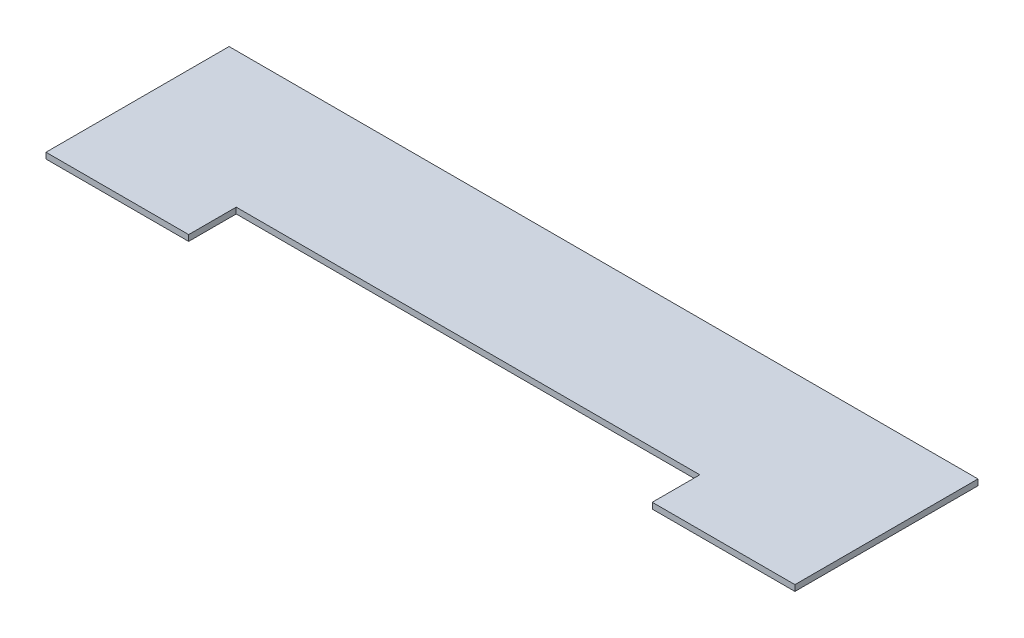
ISO-10303-21;
HEADER;
FILE_DESCRIPTION(('STEP AP214'),'2;1');
FILE_NAME('part.step','',(''),(''),'','','');
FILE_SCHEMA(('AUTOMOTIVE_DESIGN { 1 0 10303 214 1 1 1 1 }'));
ENDSEC;
DATA;
#1=APPLICATION_CONTEXT('core data for automotive mechanical design processes');
#2=APPLICATION_PROTOCOL_DEFINITION('international standard','automotive_design',2000,#1);
#3=PRODUCT_CONTEXT('',#1,'mechanical');
#4=PRODUCT('Part','Part','',(#3));
#5=PRODUCT_RELATED_PRODUCT_CATEGORY('part','',(#4));
#6=PRODUCT_DEFINITION_FORMATION('','',#4);
#7=PRODUCT_DEFINITION_CONTEXT('part definition',#1,'design');
#8=PRODUCT_DEFINITION('design','',#6,#7);
#9=PRODUCT_DEFINITION_SHAPE('','',#8);
#10=(LENGTH_UNIT() NAMED_UNIT(*) SI_UNIT(.MILLI.,.METRE.));
#11=(NAMED_UNIT(*) PLANE_ANGLE_UNIT() SI_UNIT($,.RADIAN.));
#12=(NAMED_UNIT(*) SI_UNIT($,.STERADIAN.) SOLID_ANGLE_UNIT());
#13=UNCERTAINTY_MEASURE_WITH_UNIT(LENGTH_MEASURE(1.E-05),#10,'distance_accuracy_value','');
#14=(GEOMETRIC_REPRESENTATION_CONTEXT(3) GLOBAL_UNCERTAINTY_ASSIGNED_CONTEXT((#13)) GLOBAL_UNIT_ASSIGNED_CONTEXT((#10,
#11,#12)) REPRESENTATION_CONTEXT('',''));
#15=CARTESIAN_POINT('',(0.,0.,0.));
#16=DIRECTION('',(0.,0.,1.));
#17=DIRECTION('',(1.,0.,0.));
#18=AXIS2_PLACEMENT_3D('',#15,#16,#17);
#19=CARTESIAN_POINT('',(0.,6.35,0.));
#20=DIRECTION('',(0.,0.,-1.));
#21=DIRECTION('',(-1.,0.,0.));
#22=AXIS2_PLACEMENT_3D('',#19,#20,#21);
#23=PLANE('',#22);
#24=DIRECTION('',(0.,1.,0.));
#25=VECTOR('',#24,1.);
#26=CARTESIAN_POINT('',(647.7,0.,0.));
#27=LINE('',#26,#25);
#28=CARTESIAN_POINT('',(647.7,0.,0.));
#29=VERTEX_POINT('',#28);
#30=CARTESIAN_POINT('',(647.7,6.35,0.));
#31=VERTEX_POINT('',#30);
#32=EDGE_CURVE('E115',#29,#31,#27,.T.);
#33=ORIENTED_EDGE('',*,*,#32,.F.);
#34=DIRECTION('',(1.,0.,0.));
#35=VECTOR('',#34,1.);
#36=CARTESIAN_POINT('',(0.,0.,0.));
#37=LINE('',#36,#35);
#38=CARTESIAN_POINT('',(800.1,0.,0.));
#39=VERTEX_POINT('',#38);
#40=EDGE_CURVE('E128',#29,#39,#37,.T.);
#41=ORIENTED_EDGE('',*,*,#40,.T.);
#42=DIRECTION('',(0.,-1.,0.));
#43=VECTOR('',#42,1.);
#44=CARTESIAN_POINT('',(800.1,6.35,0.));
#45=LINE('',#44,#43);
#46=CARTESIAN_POINT('',(800.1,6.35,0.));
#47=VERTEX_POINT('',#46);
#48=EDGE_CURVE('E43',#47,#39,#45,.T.);
#49=ORIENTED_EDGE('',*,*,#48,.F.);
#50=DIRECTION('',(1.,0.,0.));
#51=VECTOR('',#50,1.);
#52=CARTESIAN_POINT('',(0.,6.35,0.));
#53=LINE('',#52,#51);
#54=EDGE_CURVE('E141',#31,#47,#53,.T.);
#55=ORIENTED_EDGE('',*,*,#54,.F.);
#56=EDGE_LOOP('',(#33,#41,#49,#55));
#57=FACE_BOUND('',#56,.T.);
#58=ADVANCED_FACE('F34',(#57),#23,.F.);
#59=CARTESIAN_POINT('',(0.,6.35,0.));
#60=DIRECTION('',(-1.,0.,0.));
#61=DIRECTION('',(0.,0.,1.));
#62=AXIS2_PLACEMENT_3D('',#59,#60,#61);
#63=PLANE('',#62);
#64=DIRECTION('',(0.,0.,-1.));
#65=VECTOR('',#64,1.);
#66=CARTESIAN_POINT('',(0.,0.,0.));
#67=LINE('',#66,#65);
#68=CARTESIAN_POINT('',(0.,0.,0.));
#69=VERTEX_POINT('',#68);
#70=CARTESIAN_POINT('',(0.,0.,-195.58));
#71=VERTEX_POINT('',#70);
#72=EDGE_CURVE('E149',#69,#71,#67,.T.);
#73=ORIENTED_EDGE('',*,*,#72,.F.);
#74=DIRECTION('',(0.,-1.,0.));
#75=VECTOR('',#74,1.);
#76=CARTESIAN_POINT('',(0.,6.35,0.));
#77=LINE('',#76,#75);
#78=CARTESIAN_POINT('',(0.,6.35,0.));
#79=VERTEX_POINT('',#78);
#80=EDGE_CURVE('E11',#79,#69,#77,.T.);
#81=ORIENTED_EDGE('',*,*,#80,.F.);
#82=DIRECTION('',(0.,0.,-1.));
#83=VECTOR('',#82,1.);
#84=CARTESIAN_POINT('',(0.,6.35,0.));
#85=LINE('',#84,#83);
#86=CARTESIAN_POINT('',(0.,6.35,-195.58));
#87=VERTEX_POINT('',#86);
#88=EDGE_CURVE('E127',#79,#87,#85,.T.);
#89=ORIENTED_EDGE('',*,*,#88,.T.);
#90=DIRECTION('',(0.,-1.,0.));
#91=VECTOR('',#90,1.);
#92=CARTESIAN_POINT('',(0.,6.35,-195.58));
#93=LINE('',#92,#91);
#94=EDGE_CURVE('E38',#87,#71,#93,.T.);
#95=ORIENTED_EDGE('',*,*,#94,.T.);
#96=EDGE_LOOP('',(#73,#81,#89,#95));
#97=FACE_BOUND('',#96,.T.);
#98=ADVANCED_FACE('F36',(#97),#63,.T.);
#99=CARTESIAN_POINT('',(152.4,0.,0.));
#100=VERTEX_POINT('',#99);
#101=EDGE_CURVE('E121',#69,#100,#37,.T.);
#102=ORIENTED_EDGE('',*,*,#101,.T.);
#103=DIRECTION('',(0.,1.,0.));
#104=VECTOR('',#103,1.);
#105=CARTESIAN_POINT('',(152.4,0.,0.));
#106=LINE('',#105,#104);
#107=CARTESIAN_POINT('',(152.4,6.35,0.));
#108=VERTEX_POINT('',#107);
#109=EDGE_CURVE('E107',#100,#108,#106,.T.);
#110=ORIENTED_EDGE('',*,*,#109,.T.);
#111=EDGE_CURVE('E140',#79,#108,#53,.T.);
#112=ORIENTED_EDGE('',*,*,#111,.F.);
#113=ORIENTED_EDGE('',*,*,#80,.T.);
#114=EDGE_LOOP('',(#102,#110,#112,#113));
#115=FACE_BOUND('',#114,.T.);
#116=ADVANCED_FACE('F126',(#115),#23,.F.);
#117=CARTESIAN_POINT('',(800.1,6.35,0.));
#118=DIRECTION('',(-1.,0.,0.));
#119=DIRECTION('',(0.,0.,1.));
#120=AXIS2_PLACEMENT_3D('',#117,#118,#119);
#121=PLANE('',#120);
#122=DIRECTION('',(0.,0.,-1.));
#123=VECTOR('',#122,1.);
#124=CARTESIAN_POINT('',(800.1,0.,0.));
#125=LINE('',#124,#123);
#126=CARTESIAN_POINT('',(800.1,0.,-195.58));
#127=VERTEX_POINT('',#126);
#128=EDGE_CURVE('E132',#39,#127,#125,.T.);
#129=ORIENTED_EDGE('',*,*,#128,.T.);
#130=DIRECTION('',(0.,-1.,0.));
#131=VECTOR('',#130,1.);
#132=CARTESIAN_POINT('',(800.1,6.35,-195.58));
#133=LINE('',#132,#131);
#134=CARTESIAN_POINT('',(800.1,6.35,-195.58));
#135=VERTEX_POINT('',#134);
#136=EDGE_CURVE('E137',#135,#127,#133,.T.);
#137=ORIENTED_EDGE('',*,*,#136,.F.);
#138=DIRECTION('',(0.,0.,-1.));
#139=VECTOR('',#138,1.);
#140=CARTESIAN_POINT('',(800.1,6.35,0.));
#141=LINE('',#140,#139);
#142=EDGE_CURVE('E145',#47,#135,#141,.T.);
#143=ORIENTED_EDGE('',*,*,#142,.F.);
#144=ORIENTED_EDGE('',*,*,#48,.T.);
#145=EDGE_LOOP('',(#129,#137,#143,#144));
#146=FACE_BOUND('',#145,.T.);
#147=ADVANCED_FACE('F155',(#146),#121,.F.);
#148=CARTESIAN_POINT('',(0.,6.35,-195.58));
#149=DIRECTION('',(0.,0.,-1.));
#150=DIRECTION('',(-1.,0.,0.));
#151=AXIS2_PLACEMENT_3D('',#148,#149,#150);
#152=PLANE('',#151);
#153=DIRECTION('',(1.,0.,0.));
#154=VECTOR('',#153,1.);
#155=CARTESIAN_POINT('',(0.,0.,-195.58));
#156=LINE('',#155,#154);
#157=EDGE_CURVE('E150',#71,#127,#156,.T.);
#158=ORIENTED_EDGE('',*,*,#157,.F.);
#159=ORIENTED_EDGE('',*,*,#94,.F.);
#160=DIRECTION('',(1.,0.,0.));
#161=VECTOR('',#160,1.);
#162=CARTESIAN_POINT('',(0.,6.35,-195.58));
#163=LINE('',#162,#161);
#164=EDGE_CURVE('E130',#87,#135,#163,.T.);
#165=ORIENTED_EDGE('',*,*,#164,.T.);
#166=ORIENTED_EDGE('',*,*,#136,.T.);
#167=EDGE_LOOP('',(#158,#159,#165,#166));
#168=FACE_BOUND('',#167,.T.);
#169=ADVANCED_FACE('F196',(#168),#152,.T.);
#170=CARTESIAN_POINT('',(0.,6.35,0.));
#171=DIRECTION('',(0.,-1.,0.));
#172=DIRECTION('',(0.,0.,-1.));
#173=AXIS2_PLACEMENT_3D('',#170,#171,#172);
#174=PLANE('',#173);
#175=ORIENTED_EDGE('',*,*,#111,.T.);
#176=DIRECTION('',(0.,0.,1.));
#177=VECTOR('',#176,1.);
#178=CARTESIAN_POINT('',(152.4,6.35,-50.8));
#179=LINE('',#178,#177);
#180=CARTESIAN_POINT('',(152.4,6.35,-50.8));
#181=VERTEX_POINT('',#180);
#182=EDGE_CURVE('E113',#181,#108,#179,.T.);
#183=ORIENTED_EDGE('',*,*,#182,.F.);
#184=DIRECTION('',(1.,0.,0.));
#185=VECTOR('',#184,1.);
#186=CARTESIAN_POINT('',(152.4,6.35,-50.8));
#187=LINE('',#186,#185);
#188=CARTESIAN_POINT('',(647.7,6.35,-50.8));
#189=VERTEX_POINT('',#188);
#190=EDGE_CURVE('E124',#181,#189,#187,.T.);
#191=ORIENTED_EDGE('',*,*,#190,.T.);
#192=DIRECTION('',(0.,0.,1.));
#193=VECTOR('',#192,1.);
#194=CARTESIAN_POINT('',(647.7,6.35,-50.8));
#195=LINE('',#194,#193);
#196=EDGE_CURVE('E168',#189,#31,#195,.T.);
#197=ORIENTED_EDGE('',*,*,#196,.T.);
#198=ORIENTED_EDGE('',*,*,#54,.T.);
#199=ORIENTED_EDGE('',*,*,#142,.T.);
#200=ORIENTED_EDGE('',*,*,#164,.F.);
#201=ORIENTED_EDGE('',*,*,#88,.F.);
#202=EDGE_LOOP('',(#175,#183,#191,#197,#198,#199,#200,#201));
#203=FACE_BOUND('',#202,.T.);
#204=ADVANCED_FACE('F166',(#203),#174,.F.);
#205=CARTESIAN_POINT('',(0.,0.,0.));
#206=DIRECTION('',(0.,-1.,0.));
#207=DIRECTION('',(0.,0.,-1.));
#208=AXIS2_PLACEMENT_3D('',#205,#206,#207);
#209=PLANE('',#208);
#210=DIRECTION('',(0.,0.,1.));
#211=VECTOR('',#210,1.);
#212=CARTESIAN_POINT('',(152.4,0.,-50.8));
#213=LINE('',#212,#211);
#214=CARTESIAN_POINT('',(152.4,0.,-50.8));
#215=VERTEX_POINT('',#214);
#216=EDGE_CURVE('E110',#215,#100,#213,.T.);
#217=ORIENTED_EDGE('',*,*,#216,.T.);
#218=ORIENTED_EDGE('',*,*,#101,.F.);
#219=ORIENTED_EDGE('',*,*,#72,.T.);
#220=ORIENTED_EDGE('',*,*,#157,.T.);
#221=ORIENTED_EDGE('',*,*,#128,.F.);
#222=ORIENTED_EDGE('',*,*,#40,.F.);
#223=DIRECTION('',(0.,0.,1.));
#224=VECTOR('',#223,1.);
#225=CARTESIAN_POINT('',(647.7,0.,-50.8));
#226=LINE('',#225,#224);
#227=CARTESIAN_POINT('',(647.7,0.,-50.8));
#228=VERTEX_POINT('',#227);
#229=EDGE_CURVE('E123',#228,#29,#226,.T.);
#230=ORIENTED_EDGE('',*,*,#229,.F.);
#231=DIRECTION('',(1.,0.,0.));
#232=VECTOR('',#231,1.);
#233=CARTESIAN_POINT('',(152.4,0.,-50.8));
#234=LINE('',#233,#232);
#235=EDGE_CURVE('E116',#215,#228,#234,.T.);
#236=ORIENTED_EDGE('',*,*,#235,.F.);
#237=EDGE_LOOP('',(#217,#218,#219,#220,#221,#222,#230,#236));
#238=FACE_BOUND('',#237,.T.);
#239=ADVANCED_FACE('F119',(#238),#209,.T.);
#240=CARTESIAN_POINT('',(152.4,0.,-50.8));
#241=DIRECTION('',(-1.,0.,0.));
#242=DIRECTION('',(0.,0.,1.));
#243=AXIS2_PLACEMENT_3D('',#240,#241,#242);
#244=PLANE('',#243);
#245=ORIENTED_EDGE('',*,*,#182,.T.);
#246=ORIENTED_EDGE('',*,*,#109,.F.);
#247=ORIENTED_EDGE('',*,*,#216,.F.);
#248=DIRECTION('',(0.,1.,0.));
#249=VECTOR('',#248,1.);
#250=CARTESIAN_POINT('',(152.4,0.,-50.8));
#251=LINE('',#250,#249);
#252=EDGE_CURVE('E151',#215,#181,#251,.T.);
#253=ORIENTED_EDGE('',*,*,#252,.T.);
#254=EDGE_LOOP('',(#245,#246,#247,#253));
#255=FACE_BOUND('',#254,.T.);
#256=ADVANCED_FACE('F109',(#255),#244,.F.);
#257=CARTESIAN_POINT('',(152.4,0.,-50.8));
#258=DIRECTION('',(0.,0.,1.));
#259=DIRECTION('',(1.,0.,0.));
#260=AXIS2_PLACEMENT_3D('',#257,#258,#259);
#261=PLANE('',#260);
#262=ORIENTED_EDGE('',*,*,#190,.F.);
#263=ORIENTED_EDGE('',*,*,#252,.F.);
#264=ORIENTED_EDGE('',*,*,#235,.T.);
#265=DIRECTION('',(0.,1.,0.));
#266=VECTOR('',#265,1.);
#267=CARTESIAN_POINT('',(647.7,0.,-50.8));
#268=LINE('',#267,#266);
#269=EDGE_CURVE('E51',#228,#189,#268,.T.);
#270=ORIENTED_EDGE('',*,*,#269,.T.);
#271=EDGE_LOOP('',(#262,#263,#264,#270));
#272=FACE_BOUND('',#271,.T.);
#273=ADVANCED_FACE('F175',(#272),#261,.T.);
#274=CARTESIAN_POINT('',(647.7,0.,-50.8));
#275=DIRECTION('',(-1.,0.,0.));
#276=DIRECTION('',(0.,0.,1.));
#277=AXIS2_PLACEMENT_3D('',#274,#275,#276);
#278=PLANE('',#277);
#279=ORIENTED_EDGE('',*,*,#196,.F.);
#280=ORIENTED_EDGE('',*,*,#269,.F.);
#281=ORIENTED_EDGE('',*,*,#229,.T.);
#282=ORIENTED_EDGE('',*,*,#32,.T.);
#283=EDGE_LOOP('',(#279,#280,#281,#282));
#284=FACE_BOUND('',#283,.T.);
#285=ADVANCED_FACE('F177',(#284),#278,.T.);
#286=CLOSED_SHELL('',(#58,#98,#116,#147,#169,#204,#239,#256,#273,#285));
#287=MANIFOLD_SOLID_BREP('B2',#286);
#288=ADVANCED_BREP_SHAPE_REPRESENTATION('',(#18,#287),#14);
#289=SHAPE_DEFINITION_REPRESENTATION(#9,#288);
ENDSEC;
END-ISO-10303-21;
